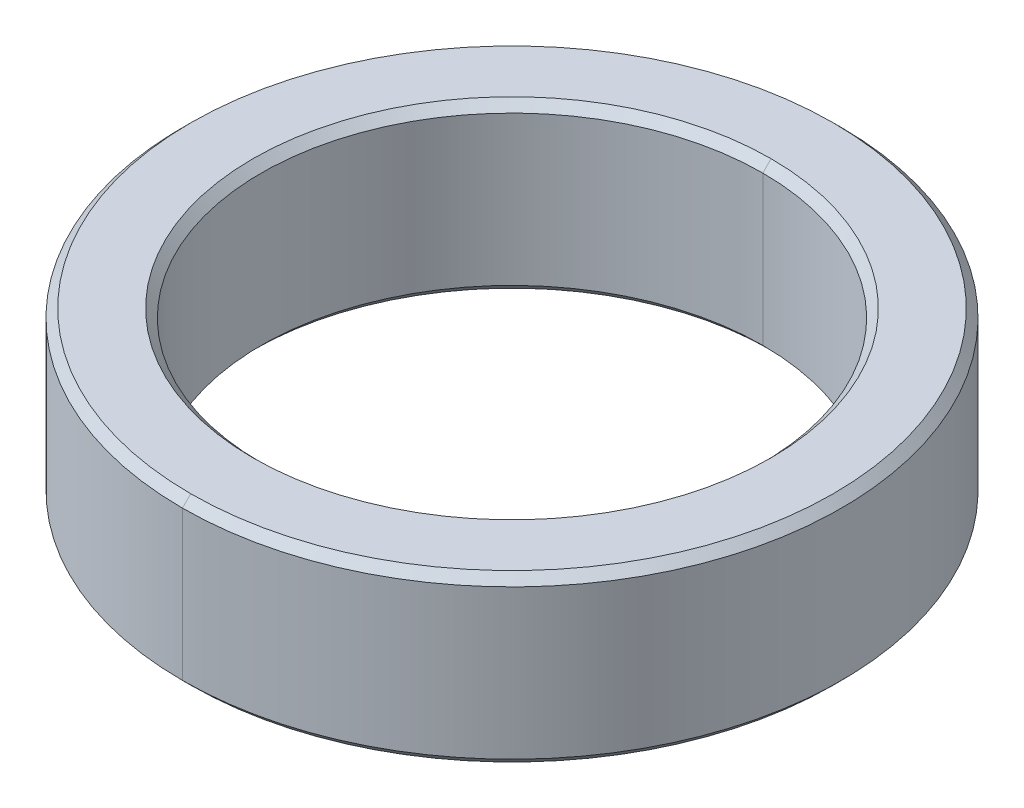
ISO-10303-21;
HEADER;
FILE_DESCRIPTION(('STEP AP214'),'2;1');
FILE_NAME('part.step','',(''),(''),'','','');
FILE_SCHEMA(('AUTOMOTIVE_DESIGN { 1 0 10303 214 1 1 1 1 }'));
ENDSEC;
DATA;
#1=APPLICATION_CONTEXT('core data for automotive mechanical design processes');
#2=APPLICATION_PROTOCOL_DEFINITION('international standard','automotive_design',2000,#1);
#3=PRODUCT_CONTEXT('',#1,'mechanical');
#4=PRODUCT('Part','Part','',(#3));
#5=PRODUCT_RELATED_PRODUCT_CATEGORY('part','',(#4));
#6=PRODUCT_DEFINITION_FORMATION('','',#4);
#7=PRODUCT_DEFINITION_CONTEXT('part definition',#1,'design');
#8=PRODUCT_DEFINITION('design','',#6,#7);
#9=PRODUCT_DEFINITION_SHAPE('','',#8);
#10=(LENGTH_UNIT() NAMED_UNIT(*) SI_UNIT(.MILLI.,.METRE.));
#11=(NAMED_UNIT(*) PLANE_ANGLE_UNIT() SI_UNIT($,.RADIAN.));
#12=(NAMED_UNIT(*) SI_UNIT($,.STERADIAN.) SOLID_ANGLE_UNIT());
#13=UNCERTAINTY_MEASURE_WITH_UNIT(LENGTH_MEASURE(1.E-05),#10,'distance_accuracy_value','');
#14=(GEOMETRIC_REPRESENTATION_CONTEXT(3) GLOBAL_UNCERTAINTY_ASSIGNED_CONTEXT((#13)) GLOBAL_UNIT_ASSIGNED_CONTEXT((#10,
#11,#12)) REPRESENTATION_CONTEXT('',''));
#15=CARTESIAN_POINT('',(0.,0.,0.));
#16=DIRECTION('',(0.,0.,1.));
#17=DIRECTION('',(1.,0.,0.));
#18=AXIS2_PLACEMENT_3D('',#15,#16,#17);
#19=CARTESIAN_POINT('',(0.,0.9,0.));
#20=DIRECTION('',(0.,1.,0.));
#21=DIRECTION('',(0.,0.,1.));
#22=AXIS2_PLACEMENT_3D('',#19,#20,#21);
#23=CONICAL_SURFACE('',#22,3.025,0.785398163397443);
#24=DIRECTION('',(0.,0.707106781186551,-0.707106781186545));
#25=VECTOR('',#24,1.);
#26=CARTESIAN_POINT('',(0.,0.9,-3.025));
#27=LINE('',#26,#25);
#28=CARTESIAN_POINT('',(0.,0.9,-3.025));
#29=VERTEX_POINT('',#28);
#30=CARTESIAN_POINT('',(0.,1.,-3.125));
#31=VERTEX_POINT('',#30);
#32=EDGE_CURVE('E129',#29,#31,#27,.T.);
#33=ORIENTED_EDGE('',*,*,#32,.F.);
#34=CARTESIAN_POINT('',(0.,0.9,0.));
#35=DIRECTION('',(0.,1.,0.));
#36=DIRECTION('',(0.,0.,1.));
#37=AXIS2_PLACEMENT_3D('',#34,#35,#36);
#38=CIRCLE('',#37,3.025);
#39=CARTESIAN_POINT('',(0.,0.9,3.025));
#40=VERTEX_POINT('',#39);
#41=EDGE_CURVE('E24',#40,#29,#38,.T.);
#42=ORIENTED_EDGE('',*,*,#41,.F.);
#43=DIRECTION('',(0.,0.707106781186551,0.707106781186545));
#44=VECTOR('',#43,1.);
#45=CARTESIAN_POINT('',(0.,0.9,3.025));
#46=LINE('',#45,#44);
#47=CARTESIAN_POINT('',(0.,1.,3.125));
#48=VERTEX_POINT('',#47);
#49=EDGE_CURVE('E139',#40,#48,#46,.T.);
#50=ORIENTED_EDGE('',*,*,#49,.T.);
#51=CARTESIAN_POINT('',(0.,1.,0.));
#52=DIRECTION('',(0.,-1.,0.));
#53=DIRECTION('',(0.,0.,1.));
#54=AXIS2_PLACEMENT_3D('',#51,#52,#53);
#55=CIRCLE('',#54,3.125);
#56=EDGE_CURVE('E131',#31,#48,#55,.T.);
#57=ORIENTED_EDGE('',*,*,#56,.F.);
#58=EDGE_LOOP('',(#33,#42,#50,#57));
#59=FACE_BOUND('',#58,.T.);
#60=ADVANCED_FACE('F15',(#59),#23,.F.);
#61=CARTESIAN_POINT('',(0.,-1.,0.));
#62=DIRECTION('',(0.,-1.,0.));
#63=DIRECTION('',(0.,0.,-1.));
#64=AXIS2_PLACEMENT_3D('',#61,#62,#63);
#65=CONICAL_SURFACE('',#64,3.125,0.785398163397446);
#66=DIRECTION('',(0.,-0.707106781186549,0.707106781186546));
#67=VECTOR('',#66,1.);
#68=CARTESIAN_POINT('',(0.,-1.,3.125));
#69=LINE('',#68,#67);
#70=CARTESIAN_POINT('',(0.,-0.9,3.025));
#71=VERTEX_POINT('',#70);
#72=CARTESIAN_POINT('',(0.,-1.,3.125));
#73=VERTEX_POINT('',#72);
#74=EDGE_CURVE('E165',#71,#73,#69,.T.);
#75=ORIENTED_EDGE('',*,*,#74,.F.);
#76=CARTESIAN_POINT('',(0.,-0.9,0.));
#77=DIRECTION('',(0.,-1.,0.));
#78=DIRECTION('',(0.,0.,1.));
#79=AXIS2_PLACEMENT_3D('',#76,#77,#78);
#80=CIRCLE('',#79,3.025);
#81=CARTESIAN_POINT('',(0.,-0.9,-3.025));
#82=VERTEX_POINT('',#81);
#83=EDGE_CURVE('E10',#82,#71,#80,.T.);
#84=ORIENTED_EDGE('',*,*,#83,.F.);
#85=DIRECTION('',(0.,-0.707106781186549,-0.707106781186546));
#86=VECTOR('',#85,1.);
#87=CARTESIAN_POINT('',(0.,-1.,-3.125));
#88=LINE('',#87,#86);
#89=CARTESIAN_POINT('',(0.,-1.,-3.125));
#90=VERTEX_POINT('',#89);
#91=EDGE_CURVE('E145',#82,#90,#88,.T.);
#92=ORIENTED_EDGE('',*,*,#91,.T.);
#93=CARTESIAN_POINT('',(0.,-1.,0.));
#94=DIRECTION('',(0.,1.,0.));
#95=DIRECTION('',(0.,0.,1.));
#96=AXIS2_PLACEMENT_3D('',#93,#94,#95);
#97=CIRCLE('',#96,3.125);
#98=EDGE_CURVE('E181',#73,#90,#97,.T.);
#99=ORIENTED_EDGE('',*,*,#98,.F.);
#100=EDGE_LOOP('',(#75,#84,#92,#99));
#101=FACE_BOUND('',#100,.T.);
#102=ADVANCED_FACE('F411',(#101),#65,.F.);
#103=CARTESIAN_POINT('',(0.,1.,0.));
#104=DIRECTION('',(0.,-1.,0.));
#105=DIRECTION('',(0.,0.,-1.));
#106=AXIS2_PLACEMENT_3D('',#103,#104,#105);
#107=CONICAL_SURFACE('',#106,3.875,0.785398163397457);
#108=DIRECTION('',(0.,-0.707106781186542,0.707106781186554));
#109=VECTOR('',#108,1.);
#110=CARTESIAN_POINT('',(0.,1.,3.875));
#111=LINE('',#110,#109);
#112=CARTESIAN_POINT('',(0.,1.,3.875));
#113=VERTEX_POINT('',#112);
#114=CARTESIAN_POINT('',(0.,0.9,3.975));
#115=VERTEX_POINT('',#114);
#116=EDGE_CURVE('E147',#113,#115,#111,.T.);
#117=ORIENTED_EDGE('',*,*,#116,.F.);
#118=CARTESIAN_POINT('',(0.,1.,0.));
#119=DIRECTION('',(0.,1.,0.));
#120=DIRECTION('',(0.,0.,1.));
#121=AXIS2_PLACEMENT_3D('',#118,#119,#120);
#122=CIRCLE('',#121,3.875);
#123=CARTESIAN_POINT('',(0.,1.,-3.875));
#124=VERTEX_POINT('',#123);
#125=EDGE_CURVE('E205',#124,#113,#122,.T.);
#126=ORIENTED_EDGE('',*,*,#125,.F.);
#127=DIRECTION('',(0.,-0.707106781186542,-0.707106781186554));
#128=VECTOR('',#127,1.);
#129=CARTESIAN_POINT('',(0.,1.,-3.875));
#130=LINE('',#129,#128);
#131=CARTESIAN_POINT('',(0.,0.9,-3.975));
#132=VERTEX_POINT('',#131);
#133=EDGE_CURVE('E162',#124,#132,#130,.T.);
#134=ORIENTED_EDGE('',*,*,#133,.T.);
#135=CARTESIAN_POINT('',(0.,0.9,0.));
#136=DIRECTION('',(0.,-1.,0.));
#137=DIRECTION('',(0.,0.,1.));
#138=AXIS2_PLACEMENT_3D('',#135,#136,#137);
#139=CIRCLE('',#138,3.975);
#140=EDGE_CURVE('E79',#115,#132,#139,.T.);
#141=ORIENTED_EDGE('',*,*,#140,.F.);
#142=EDGE_LOOP('',(#117,#126,#134,#141));
#143=FACE_BOUND('',#142,.T.);
#144=ADVANCED_FACE('F415',(#143),#107,.T.);
#145=CARTESIAN_POINT('',(0.,-0.9,0.));
#146=DIRECTION('',(0.,1.,0.));
#147=DIRECTION('',(0.,0.,1.));
#148=AXIS2_PLACEMENT_3D('',#145,#146,#147);
#149=CONICAL_SURFACE('',#148,3.975,0.785398163397448);
#150=DIRECTION('',(0.,0.707106781186548,-0.707106781186548));
#151=VECTOR('',#150,1.);
#152=CARTESIAN_POINT('',(0.,-0.9,-3.975));
#153=LINE('',#152,#151);
#154=CARTESIAN_POINT('',(0.,-1.,-3.875));
#155=VERTEX_POINT('',#154);
#156=CARTESIAN_POINT('',(0.,-0.9,-3.975));
#157=VERTEX_POINT('',#156);
#158=EDGE_CURVE('E161',#155,#157,#153,.T.);
#159=ORIENTED_EDGE('',*,*,#158,.F.);
#160=CARTESIAN_POINT('',(0.,-1.,0.));
#161=DIRECTION('',(0.,-1.,0.));
#162=DIRECTION('',(0.,0.,1.));
#163=AXIS2_PLACEMENT_3D('',#160,#161,#162);
#164=CIRCLE('',#163,3.875);
#165=CARTESIAN_POINT('',(0.,-1.,3.875));
#166=VERTEX_POINT('',#165);
#167=EDGE_CURVE('E178',#166,#155,#164,.T.);
#168=ORIENTED_EDGE('',*,*,#167,.F.);
#169=DIRECTION('',(0.,0.707106781186548,0.707106781186548));
#170=VECTOR('',#169,1.);
#171=CARTESIAN_POINT('',(0.,-0.9,3.975));
#172=LINE('',#171,#170);
#173=CARTESIAN_POINT('',(0.,-0.9,3.975));
#174=VERTEX_POINT('',#173);
#175=EDGE_CURVE('E170',#166,#174,#172,.T.);
#176=ORIENTED_EDGE('',*,*,#175,.T.);
#177=CARTESIAN_POINT('',(0.,-0.9,0.));
#178=DIRECTION('',(0.,1.,0.));
#179=DIRECTION('',(0.,0.,1.));
#180=AXIS2_PLACEMENT_3D('',#177,#178,#179);
#181=CIRCLE('',#180,3.975);
#182=EDGE_CURVE('E38',#157,#174,#181,.T.);
#183=ORIENTED_EDGE('',*,*,#182,.F.);
#184=EDGE_LOOP('',(#159,#168,#176,#183));
#185=FACE_BOUND('',#184,.T.);
#186=ADVANCED_FACE('F364',(#185),#149,.T.);
#187=CARTESIAN_POINT('',(0.,1.,0.));
#188=DIRECTION('',(0.,-1.,0.));
#189=DIRECTION('',(0.,0.,-1.));
#190=AXIS2_PLACEMENT_3D('',#187,#188,#189);
#191=CYLINDRICAL_SURFACE('',#190,3.025);
#192=DIRECTION('',(0.,-1.,0.));
#193=VECTOR('',#192,1.);
#194=CARTESIAN_POINT('',(0.,1.,3.025));
#195=LINE('',#194,#193);
#196=EDGE_CURVE('E111',#40,#71,#195,.T.);
#197=ORIENTED_EDGE('',*,*,#196,.F.);
#198=ORIENTED_EDGE('',*,*,#41,.T.);
#199=DIRECTION('',(0.,-1.,0.));
#200=VECTOR('',#199,1.);
#201=CARTESIAN_POINT('',(0.,1.,-3.025));
#202=LINE('',#201,#200);
#203=EDGE_CURVE('E108',#29,#82,#202,.T.);
#204=ORIENTED_EDGE('',*,*,#203,.T.);
#205=ORIENTED_EDGE('',*,*,#83,.T.);
#206=EDGE_LOOP('',(#197,#198,#204,#205));
#207=FACE_BOUND('',#206,.T.);
#208=ADVANCED_FACE('F107',(#207),#191,.F.);
#209=CARTESIAN_POINT('',(0.,1.,0.));
#210=DIRECTION('',(0.,-1.,0.));
#211=DIRECTION('',(0.,0.,-1.));
#212=AXIS2_PLACEMENT_3D('',#209,#210,#211);
#213=CYLINDRICAL_SURFACE('',#212,3.975);
#214=DIRECTION('',(0.,-1.,0.));
#215=VECTOR('',#214,1.);
#216=CARTESIAN_POINT('',(0.,1.,3.975));
#217=LINE('',#216,#215);
#218=EDGE_CURVE('E126',#115,#174,#217,.T.);
#219=ORIENTED_EDGE('',*,*,#218,.F.);
#220=ORIENTED_EDGE('',*,*,#140,.T.);
#221=DIRECTION('',(0.,-1.,0.));
#222=VECTOR('',#221,1.);
#223=CARTESIAN_POINT('',(0.,1.,-3.975));
#224=LINE('',#223,#222);
#225=EDGE_CURVE('E202',#132,#157,#224,.T.);
#226=ORIENTED_EDGE('',*,*,#225,.T.);
#227=ORIENTED_EDGE('',*,*,#182,.T.);
#228=EDGE_LOOP('',(#219,#220,#226,#227));
#229=FACE_BOUND('',#228,.T.);
#230=ADVANCED_FACE('F343',(#229),#213,.T.);
#231=CARTESIAN_POINT('',(0.,-1.,0.));
#232=DIRECTION('',(0.,1.,0.));
#233=DIRECTION('',(1.,0.,0.));
#234=AXIS2_PLACEMENT_3D('',#231,#232,#233);
#235=PLANE('',#234);
#236=CARTESIAN_POINT('',(0.,-1.,0.));
#237=DIRECTION('',(0.,1.,0.));
#238=DIRECTION('',(0.,0.,1.));
#239=AXIS2_PLACEMENT_3D('',#236,#237,#238);
#240=CIRCLE('',#239,3.125);
#241=EDGE_CURVE('E174',#90,#73,#240,.T.);
#242=ORIENTED_EDGE('',*,*,#241,.T.);
#243=ORIENTED_EDGE('',*,*,#98,.T.);
#244=EDGE_LOOP('',(#242,#243));
#245=FACE_BOUND('',#244,.T.);
#246=ORIENTED_EDGE('',*,*,#167,.T.);
#247=CARTESIAN_POINT('',(0.,-1.,0.));
#248=DIRECTION('',(0.,-1.,0.));
#249=DIRECTION('',(0.,0.,1.));
#250=AXIS2_PLACEMENT_3D('',#247,#248,#249);
#251=CIRCLE('',#250,3.875);
#252=EDGE_CURVE('E157',#155,#166,#251,.T.);
#253=ORIENTED_EDGE('',*,*,#252,.T.);
#254=EDGE_LOOP('',(#246,#253));
#255=FACE_BOUND('',#254,.T.);
#256=ADVANCED_FACE('F347',(#245,#255),#235,.F.);
#257=CARTESIAN_POINT('',(0.,1.,0.));
#258=DIRECTION('',(0.,1.,0.));
#259=DIRECTION('',(1.,0.,0.));
#260=AXIS2_PLACEMENT_3D('',#257,#258,#259);
#261=PLANE('',#260);
#262=CARTESIAN_POINT('',(0.,1.,0.));
#263=DIRECTION('',(0.,-1.,0.));
#264=DIRECTION('',(0.,0.,1.));
#265=AXIS2_PLACEMENT_3D('',#262,#263,#264);
#266=CIRCLE('',#265,3.125);
#267=EDGE_CURVE('E136',#48,#31,#266,.T.);
#268=ORIENTED_EDGE('',*,*,#267,.T.);
#269=ORIENTED_EDGE('',*,*,#56,.T.);
#270=EDGE_LOOP('',(#268,#269));
#271=FACE_BOUND('',#270,.T.);
#272=ORIENTED_EDGE('',*,*,#125,.T.);
#273=CARTESIAN_POINT('',(0.,1.,0.));
#274=DIRECTION('',(0.,1.,0.));
#275=DIRECTION('',(0.,0.,1.));
#276=AXIS2_PLACEMENT_3D('',#273,#274,#275);
#277=CIRCLE('',#276,3.875);
#278=EDGE_CURVE('E152',#113,#124,#277,.T.);
#279=ORIENTED_EDGE('',*,*,#278,.T.);
#280=EDGE_LOOP('',(#272,#279));
#281=FACE_BOUND('',#280,.T.);
#282=ADVANCED_FACE('F397',(#271,#281),#261,.T.);
#283=CARTESIAN_POINT('',(0.,1.,0.));
#284=DIRECTION('',(0.,-1.,0.));
#285=DIRECTION('',(0.,0.,-1.));
#286=AXIS2_PLACEMENT_3D('',#283,#284,#285);
#287=CYLINDRICAL_SURFACE('',#286,3.975);
#288=CARTESIAN_POINT('',(0.,0.9,0.));
#289=DIRECTION('',(0.,-1.,0.));
#290=DIRECTION('',(0.,0.,1.));
#291=AXIS2_PLACEMENT_3D('',#288,#289,#290);
#292=CIRCLE('',#291,3.975);
#293=EDGE_CURVE('E151',#132,#115,#292,.T.);
#294=ORIENTED_EDGE('',*,*,#293,.T.);
#295=ORIENTED_EDGE('',*,*,#218,.T.);
#296=CARTESIAN_POINT('',(0.,-0.9,0.));
#297=DIRECTION('',(0.,1.,0.));
#298=DIRECTION('',(0.,0.,1.));
#299=AXIS2_PLACEMENT_3D('',#296,#297,#298);
#300=CIRCLE('',#299,3.975);
#301=EDGE_CURVE('E166',#174,#157,#300,.T.);
#302=ORIENTED_EDGE('',*,*,#301,.T.);
#303=ORIENTED_EDGE('',*,*,#225,.F.);
#304=EDGE_LOOP('',(#294,#295,#302,#303));
#305=FACE_BOUND('',#304,.T.);
#306=ADVANCED_FACE('F389',(#305),#287,.T.);
#307=CARTESIAN_POINT('',(0.,1.,0.));
#308=DIRECTION('',(0.,-1.,0.));
#309=DIRECTION('',(0.,0.,-1.));
#310=AXIS2_PLACEMENT_3D('',#307,#308,#309);
#311=CYLINDRICAL_SURFACE('',#310,3.025);
#312=CARTESIAN_POINT('',(0.,0.9,0.));
#313=DIRECTION('',(0.,1.,0.));
#314=DIRECTION('',(0.,0.,1.));
#315=AXIS2_PLACEMENT_3D('',#312,#313,#314);
#316=CIRCLE('',#315,3.025);
#317=EDGE_CURVE('E122',#29,#40,#316,.T.);
#318=ORIENTED_EDGE('',*,*,#317,.T.);
#319=ORIENTED_EDGE('',*,*,#196,.T.);
#320=CARTESIAN_POINT('',(0.,-0.9,0.));
#321=DIRECTION('',(0.,-1.,0.));
#322=DIRECTION('',(0.,0.,1.));
#323=AXIS2_PLACEMENT_3D('',#320,#321,#322);
#324=CIRCLE('',#323,3.025);
#325=EDGE_CURVE('E124',#71,#82,#324,.T.);
#326=ORIENTED_EDGE('',*,*,#325,.T.);
#327=ORIENTED_EDGE('',*,*,#203,.F.);
#328=EDGE_LOOP('',(#318,#319,#326,#327));
#329=FACE_BOUND('',#328,.T.);
#330=ADVANCED_FACE('F120',(#329),#311,.F.);
#331=CARTESIAN_POINT('',(0.,-0.9,0.));
#332=DIRECTION('',(0.,1.,0.));
#333=DIRECTION('',(0.,0.,1.));
#334=AXIS2_PLACEMENT_3D('',#331,#332,#333);
#335=CONICAL_SURFACE('',#334,3.975,0.785398163397448);
#336=ORIENTED_EDGE('',*,*,#252,.F.);
#337=ORIENTED_EDGE('',*,*,#158,.T.);
#338=ORIENTED_EDGE('',*,*,#301,.F.);
#339=ORIENTED_EDGE('',*,*,#175,.F.);
#340=EDGE_LOOP('',(#336,#337,#338,#339));
#341=FACE_BOUND('',#340,.T.);
#342=ADVANCED_FACE('F372',(#341),#335,.T.);
#343=CARTESIAN_POINT('',(0.,1.,0.));
#344=DIRECTION('',(0.,-1.,0.));
#345=DIRECTION('',(0.,0.,-1.));
#346=AXIS2_PLACEMENT_3D('',#343,#344,#345);
#347=CONICAL_SURFACE('',#346,3.875,0.785398163397457);
#348=ORIENTED_EDGE('',*,*,#278,.F.);
#349=ORIENTED_EDGE('',*,*,#116,.T.);
#350=ORIENTED_EDGE('',*,*,#293,.F.);
#351=ORIENTED_EDGE('',*,*,#133,.F.);
#352=EDGE_LOOP('',(#348,#349,#350,#351));
#353=FACE_BOUND('',#352,.T.);
#354=ADVANCED_FACE('F355',(#353),#347,.T.);
#355=CARTESIAN_POINT('',(0.,-1.,0.));
#356=DIRECTION('',(0.,-1.,0.));
#357=DIRECTION('',(0.,0.,-1.));
#358=AXIS2_PLACEMENT_3D('',#355,#356,#357);
#359=CONICAL_SURFACE('',#358,3.125,0.785398163397446);
#360=ORIENTED_EDGE('',*,*,#325,.F.);
#361=ORIENTED_EDGE('',*,*,#74,.T.);
#362=ORIENTED_EDGE('',*,*,#241,.F.);
#363=ORIENTED_EDGE('',*,*,#91,.F.);
#364=EDGE_LOOP('',(#360,#361,#362,#363));
#365=FACE_BOUND('',#364,.T.);
#366=ADVANCED_FACE('F338',(#365),#359,.F.);
#367=CARTESIAN_POINT('',(0.,0.9,0.));
#368=DIRECTION('',(0.,1.,0.));
#369=DIRECTION('',(0.,0.,1.));
#370=AXIS2_PLACEMENT_3D('',#367,#368,#369);
#371=CONICAL_SURFACE('',#370,3.025,0.785398163397443);
#372=ORIENTED_EDGE('',*,*,#317,.F.);
#373=ORIENTED_EDGE('',*,*,#32,.T.);
#374=ORIENTED_EDGE('',*,*,#267,.F.);
#375=ORIENTED_EDGE('',*,*,#49,.F.);
#376=EDGE_LOOP('',(#372,#373,#374,#375));
#377=FACE_BOUND('',#376,.T.);
#378=ADVANCED_FACE('F138',(#377),#371,.F.);
#379=CLOSED_SHELL('',(#60,#102,#144,#186,#208,#230,#256,#282,#306,#330,#342,#354,#366,#378));
#380=MANIFOLD_SOLID_BREP('B1',#379);
#381=ADVANCED_BREP_SHAPE_REPRESENTATION('',(#18,#380),#14);
#382=SHAPE_DEFINITION_REPRESENTATION(#9,#381);
ENDSEC;
END-ISO-10303-21;
